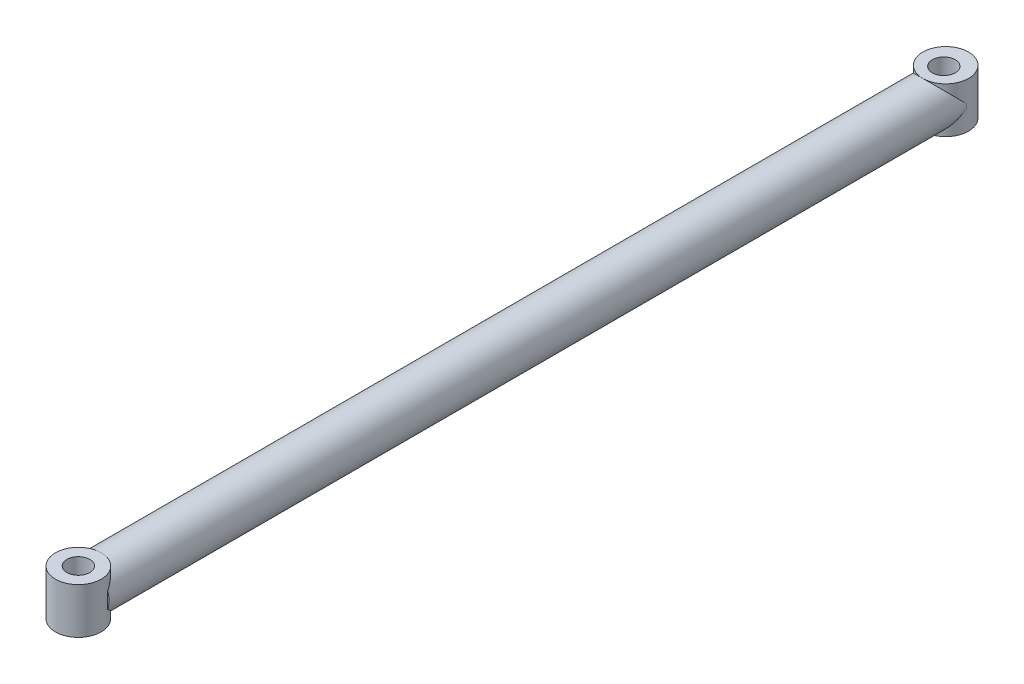
ISO-10303-21;
HEADER;
FILE_DESCRIPTION(('STEP AP214'),'2;1');
FILE_NAME('part.step','',(''),(''),'','','');
FILE_SCHEMA(('AUTOMOTIVE_DESIGN { 1 0 10303 214 1 1 1 1 }'));
ENDSEC;
DATA;
#1=APPLICATION_CONTEXT('core data for automotive mechanical design processes');
#2=APPLICATION_PROTOCOL_DEFINITION('international standard','automotive_design',2000,#1);
#3=PRODUCT_CONTEXT('',#1,'mechanical');
#4=PRODUCT('Part','Part','',(#3));
#5=PRODUCT_RELATED_PRODUCT_CATEGORY('part','',(#4));
#6=PRODUCT_DEFINITION_FORMATION('','',#4);
#7=PRODUCT_DEFINITION_CONTEXT('part definition',#1,'design');
#8=PRODUCT_DEFINITION('design','',#6,#7);
#9=PRODUCT_DEFINITION_SHAPE('','',#8);
#10=(LENGTH_UNIT() NAMED_UNIT(*) SI_UNIT(.MILLI.,.METRE.));
#11=(NAMED_UNIT(*) PLANE_ANGLE_UNIT() SI_UNIT($,.RADIAN.));
#12=(NAMED_UNIT(*) SI_UNIT($,.STERADIAN.) SOLID_ANGLE_UNIT());
#13=UNCERTAINTY_MEASURE_WITH_UNIT(LENGTH_MEASURE(1.E-05),#10,'distance_accuracy_value','');
#14=(GEOMETRIC_REPRESENTATION_CONTEXT(3) GLOBAL_UNCERTAINTY_ASSIGNED_CONTEXT((#13)) GLOBAL_UNIT_ASSIGNED_CONTEXT((#10,
#11,#12)) REPRESENTATION_CONTEXT('',''));
#15=CARTESIAN_POINT('',(0.,0.,0.));
#16=DIRECTION('',(0.,0.,1.));
#17=DIRECTION('',(1.,0.,0.));
#18=AXIS2_PLACEMENT_3D('',#15,#16,#17);
#19=CARTESIAN_POINT('',(0.,0.,0.));
#20=DIRECTION('',(0.,0.,1.));
#21=DIRECTION('',(1.,0.,0.));
#22=AXIS2_PLACEMENT_3D('',#19,#20,#21);
#23=PLANE('',#22);
#24=CARTESIAN_POINT('',(0.,0.,0.));
#25=DIRECTION('',(0.,0.,1.));
#26=DIRECTION('',(1.,0.,0.));
#27=AXIS2_PLACEMENT_3D('',#24,#25,#26);
#28=CIRCLE('',#27,2.);
#29=CARTESIAN_POINT('',(1.99350467347526,-0.161056253626736,0.));
#30=VERTEX_POINT('',#29);
#31=CARTESIAN_POINT('',(1.99350467347526,0.161056253626737,0.));
#32=VERTEX_POINT('',#31);
#33=EDGE_CURVE('E144',#30,#32,#28,.T.);
#34=ORIENTED_EDGE('',*,*,#33,.F.);
#35=DIRECTION('',(0.,1.,0.));
#36=VECTOR('',#35,1.);
#37=CARTESIAN_POINT('',(1.99350467347526,-2.,0.));
#38=LINE('',#37,#36);
#39=EDGE_CURVE('E11',#30,#32,#38,.T.);
#40=ORIENTED_EDGE('',*,*,#39,.T.);
#41=EDGE_LOOP('',(#34,#40));
#42=FACE_BOUND('',#41,.T.);
#43=ADVANCED_FACE('F39',(#42),#23,.F.);
#44=CARTESIAN_POINT('',(0.,0.,75.));
#45=DIRECTION('',(0.,0.,1.));
#46=DIRECTION('',(1.,0.,0.));
#47=AXIS2_PLACEMENT_3D('',#44,#45,#46);
#48=PLANE('',#47);
#49=DIRECTION('',(0.,1.,0.));
#50=VECTOR('',#49,1.);
#51=CARTESIAN_POINT('',(1.87763174463558,-2.,75.));
#52=LINE('',#51,#50);
#53=CARTESIAN_POINT('',(1.87763174463558,-0.688838901004249,75.));
#54=VERTEX_POINT('',#53);
#55=CARTESIAN_POINT('',(1.87763174463558,0.688838901004249,75.));
#56=VERTEX_POINT('',#55);
#57=EDGE_CURVE('E152',#54,#56,#52,.T.);
#58=ORIENTED_EDGE('',*,*,#57,.F.);
#59=CARTESIAN_POINT('',(0.,0.,75.));
#60=DIRECTION('',(0.,0.,1.));
#61=DIRECTION('',(1.,0.,0.));
#62=AXIS2_PLACEMENT_3D('',#59,#60,#61);
#63=CIRCLE('',#62,2.);
#64=EDGE_CURVE('E138',#54,#56,#63,.T.);
#65=ORIENTED_EDGE('',*,*,#64,.T.);
#66=EDGE_LOOP('',(#58,#65));
#67=FACE_BOUND('',#66,.T.);
#68=ADVANCED_FACE('F168',(#67),#48,.T.);
#69=CARTESIAN_POINT('',(0.,0.,75.));
#70=DIRECTION('',(0.,0.,-1.));
#71=DIRECTION('',(-1.,0.,0.));
#72=AXIS2_PLACEMENT_3D('',#69,#70,#71);
#73=CYLINDRICAL_SURFACE('',#72,2.);
#74=ORIENTED_EDGE('',*,*,#64,.F.);
#75=CARTESIAN_POINT('',(0.,0.,75.6888389010042));
#76=DIRECTION('',(0.,0.707106781186547,-0.707106781186547));
#77=DIRECTION('',(0.,-0.707106781186547,-0.707106781186547));
#78=AXIS2_PLACEMENT_3D('',#75,#76,#77);
#79=ELLIPSE('',#78,2.82842712474619,2.);
#80=CARTESIAN_POINT('',(0.,-2.,73.6888389010042));
#81=VERTEX_POINT('',#80);
#82=EDGE_CURVE('E63',#54,#81,#79,.T.);
#83=ORIENTED_EDGE('',*,*,#82,.T.);
#84=CARTESIAN_POINT('',(-1.87763174463558,-0.688838901004249,75.));
#85=VERTEX_POINT('',#84);
#86=EDGE_CURVE('E134',#81,#85,#79,.T.);
#87=ORIENTED_EDGE('',*,*,#86,.T.);
#88=CARTESIAN_POINT('',(-1.87763174463558,0.688838901004249,75.));
#89=VERTEX_POINT('',#88);
#90=EDGE_CURVE('E142',#89,#85,#63,.T.);
#91=ORIENTED_EDGE('',*,*,#90,.F.);
#92=CARTESIAN_POINT('',(0.,0.,75.6888389010042));
#93=DIRECTION('',(0.,-0.707106781186547,-0.707106781186547));
#94=DIRECTION('',(0.,0.707106781186547,-0.707106781186547));
#95=AXIS2_PLACEMENT_3D('',#92,#93,#94);
#96=ELLIPSE('',#95,2.82842712474619,2.);
#97=CARTESIAN_POINT('',(0.,2.,73.6888389010042));
#98=VERTEX_POINT('',#97);
#99=EDGE_CURVE('E127',#89,#98,#96,.T.);
#100=ORIENTED_EDGE('',*,*,#99,.T.);
#101=EDGE_CURVE('E135',#98,#56,#96,.T.);
#102=ORIENTED_EDGE('',*,*,#101,.T.);
#103=EDGE_LOOP('',(#74,#83,#87,#91,#100,#102));
#104=FACE_BOUND('',#103,.T.);
#105=ORIENTED_EDGE('',*,*,#33,.T.);
#106=CARTESIAN_POINT('',(0.,0.,-0.161056253626737));
#107=DIRECTION('',(0.,0.707106781186547,-0.707106781186547));
#108=DIRECTION('',(0.,-0.707106781186547,-0.707106781186547));
#109=AXIS2_PLACEMENT_3D('',#106,#107,#108);
#110=ELLIPSE('',#109,2.82842712474619,2.);
#111=CARTESIAN_POINT('',(0.,2.,1.83894374637326));
#112=VERTEX_POINT('',#111);
#113=EDGE_CURVE('E104',#32,#112,#110,.F.);
#114=ORIENTED_EDGE('',*,*,#113,.T.);
#115=CARTESIAN_POINT('',(-1.99350467347526,0.161056253626736,0.));
#116=VERTEX_POINT('',#115);
#117=EDGE_CURVE('E95',#112,#116,#110,.F.);
#118=ORIENTED_EDGE('',*,*,#117,.T.);
#119=CARTESIAN_POINT('',(-1.99350467347526,-0.161056253626736,0.));
#120=VERTEX_POINT('',#119);
#121=EDGE_CURVE('E143',#116,#120,#28,.T.);
#122=ORIENTED_EDGE('',*,*,#121,.T.);
#123=CARTESIAN_POINT('',(0.,0.,-0.161056253626737));
#124=DIRECTION('',(0.,-0.707106781186547,-0.707106781186547));
#125=DIRECTION('',(0.,0.707106781186547,-0.707106781186547));
#126=AXIS2_PLACEMENT_3D('',#123,#124,#125);
#127=ELLIPSE('',#126,2.82842712474619,2.);
#128=CARTESIAN_POINT('',(0.,-2.,1.83894374637326));
#129=VERTEX_POINT('',#128);
#130=EDGE_CURVE('E55',#120,#129,#127,.F.);
#131=ORIENTED_EDGE('',*,*,#130,.T.);
#132=EDGE_CURVE('E121',#129,#30,#127,.F.);
#133=ORIENTED_EDGE('',*,*,#132,.T.);
#134=EDGE_LOOP('',(#105,#114,#118,#122,#131,#133));
#135=FACE_BOUND('',#134,.T.);
#136=ADVANCED_FACE('F41',(#104,#135),#73,.T.);
#137=DIRECTION('',(0.,1.,0.));
#138=VECTOR('',#137,1.);
#139=CARTESIAN_POINT('',(-1.87763174463558,-2.,75.));
#140=LINE('',#139,#138);
#141=EDGE_CURVE('E148',#89,#85,#140,.F.);
#142=ORIENTED_EDGE('',*,*,#141,.F.);
#143=ORIENTED_EDGE('',*,*,#90,.T.);
#144=EDGE_LOOP('',(#142,#143));
#145=FACE_BOUND('',#144,.T.);
#146=ADVANCED_FACE('F174',(#145),#48,.T.);
#147=ORIENTED_EDGE('',*,*,#121,.F.);
#148=DIRECTION('',(0.,1.,0.));
#149=VECTOR('',#148,1.);
#150=CARTESIAN_POINT('',(-1.99350467347526,-2.,0.));
#151=LINE('',#150,#149);
#152=EDGE_CURVE('E48',#116,#120,#151,.F.);
#153=ORIENTED_EDGE('',*,*,#152,.T.);
#154=EDGE_LOOP('',(#147,#153));
#155=FACE_BOUND('',#154,.T.);
#156=ADVANCED_FACE('F157',(#155),#23,.F.);
#157=CARTESIAN_POINT('',(0.,-2.,75.6888389010042));
#158=DIRECTION('',(0.,1.,0.));
#159=DIRECTION('',(0.,0.,1.));
#160=AXIS2_PLACEMENT_3D('',#157,#158,#159);
#161=CYLINDRICAL_SURFACE('',#160,2.);
#162=ORIENTED_EDGE('',*,*,#101,.F.);
#163=CARTESIAN_POINT('',(0.,2.,75.6888389010042));
#164=DIRECTION('',(0.,1.,0.));
#165=DIRECTION('',(0.,0.,1.));
#166=AXIS2_PLACEMENT_3D('',#163,#164,#165);
#167=CIRCLE('',#166,2.);
#168=EDGE_CURVE('E128',#98,#98,#167,.T.);
#169=ORIENTED_EDGE('',*,*,#168,.F.);
#170=ORIENTED_EDGE('',*,*,#99,.F.);
#171=ORIENTED_EDGE('',*,*,#141,.T.);
#172=ORIENTED_EDGE('',*,*,#86,.F.);
#173=CARTESIAN_POINT('',(0.,-2.,75.6888389010042));
#174=DIRECTION('',(0.,1.,0.));
#175=DIRECTION('',(0.,0.,1.));
#176=AXIS2_PLACEMENT_3D('',#173,#174,#175);
#177=CIRCLE('',#176,2.);
#178=EDGE_CURVE('E123',#81,#81,#177,.T.);
#179=ORIENTED_EDGE('',*,*,#178,.T.);
#180=ORIENTED_EDGE('',*,*,#82,.F.);
#181=ORIENTED_EDGE('',*,*,#57,.T.);
#182=EDGE_LOOP('',(#162,#169,#170,#171,#172,#179,#180,#181));
#183=FACE_BOUND('',#182,.T.);
#184=ADVANCED_FACE('F176',(#183),#161,.T.);
#185=CARTESIAN_POINT('',(0.,-2.,75.6888389010042));
#186=DIRECTION('',(0.,1.,0.));
#187=DIRECTION('',(0.,0.,1.));
#188=AXIS2_PLACEMENT_3D('',#185,#186,#187);
#189=PLANE('',#188);
#190=CARTESIAN_POINT('',(0.,-2.,75.6888389010042));
#191=DIRECTION('',(0.,1.,0.));
#192=DIRECTION('',(0.,0.,1.));
#193=AXIS2_PLACEMENT_3D('',#190,#191,#192);
#194=CIRCLE('',#193,1.);
#195=CARTESIAN_POINT('',(0.,-2.,76.6888389010042));
#196=VERTEX_POINT('',#195);
#197=EDGE_CURVE('E110',#196,#196,#194,.T.);
#198=ORIENTED_EDGE('',*,*,#197,.T.);
#199=EDGE_LOOP('',(#198));
#200=FACE_BOUND('',#199,.T.);
#201=ORIENTED_EDGE('',*,*,#178,.F.);
#202=EDGE_LOOP('',(#201));
#203=FACE_BOUND('',#202,.T.);
#204=ADVANCED_FACE('F181',(#200,#203),#189,.F.);
#205=CARTESIAN_POINT('',(0.,2.,75.6888389010042));
#206=DIRECTION('',(0.,1.,0.));
#207=DIRECTION('',(0.,0.,1.));
#208=AXIS2_PLACEMENT_3D('',#205,#206,#207);
#209=PLANE('',#208);
#210=CARTESIAN_POINT('',(0.,2.,75.6888389010042));
#211=DIRECTION('',(0.,1.,0.));
#212=DIRECTION('',(0.,0.,1.));
#213=AXIS2_PLACEMENT_3D('',#210,#211,#212);
#214=CIRCLE('',#213,1.);
#215=CARTESIAN_POINT('',(0.,2.,76.6888389010042));
#216=VERTEX_POINT('',#215);
#217=EDGE_CURVE('E116',#216,#216,#214,.T.);
#218=ORIENTED_EDGE('',*,*,#217,.F.);
#219=EDGE_LOOP('',(#218));
#220=FACE_BOUND('',#219,.T.);
#221=ORIENTED_EDGE('',*,*,#168,.T.);
#222=EDGE_LOOP('',(#221));
#223=FACE_BOUND('',#222,.T.);
#224=ADVANCED_FACE('F189',(#220,#223),#209,.T.);
#225=CARTESIAN_POINT('',(0.,-2.,-0.161056253626737));
#226=DIRECTION('',(0.,1.,0.));
#227=DIRECTION('',(0.,0.,1.));
#228=AXIS2_PLACEMENT_3D('',#225,#226,#227);
#229=CYLINDRICAL_SURFACE('',#228,2.);
#230=ORIENTED_EDGE('',*,*,#132,.F.);
#231=CARTESIAN_POINT('',(0.,-2.,-0.161056253626737));
#232=DIRECTION('',(0.,1.,0.));
#233=DIRECTION('',(0.,0.,1.));
#234=AXIS2_PLACEMENT_3D('',#231,#232,#233);
#235=CIRCLE('',#234,2.);
#236=EDGE_CURVE('E109',#129,#129,#235,.T.);
#237=ORIENTED_EDGE('',*,*,#236,.T.);
#238=ORIENTED_EDGE('',*,*,#130,.F.);
#239=ORIENTED_EDGE('',*,*,#152,.F.);
#240=ORIENTED_EDGE('',*,*,#117,.F.);
#241=CARTESIAN_POINT('',(0.,2.,-0.161056253626737));
#242=DIRECTION('',(0.,1.,0.));
#243=DIRECTION('',(0.,0.,1.));
#244=AXIS2_PLACEMENT_3D('',#241,#242,#243);
#245=CIRCLE('',#244,2.);
#246=EDGE_CURVE('E98',#112,#112,#245,.T.);
#247=ORIENTED_EDGE('',*,*,#246,.F.);
#248=ORIENTED_EDGE('',*,*,#113,.F.);
#249=ORIENTED_EDGE('',*,*,#39,.F.);
#250=EDGE_LOOP('',(#230,#237,#238,#239,#240,#247,#248,#249));
#251=FACE_BOUND('',#250,.T.);
#252=ADVANCED_FACE('F97',(#251),#229,.T.);
#253=CARTESIAN_POINT('',(0.,-2.,-0.161056253626737));
#254=DIRECTION('',(0.,1.,0.));
#255=DIRECTION('',(0.,0.,1.));
#256=AXIS2_PLACEMENT_3D('',#253,#254,#255);
#257=PLANE('',#256);
#258=CARTESIAN_POINT('',(0.,-2.,0.));
#259=DIRECTION('',(0.,1.,0.));
#260=DIRECTION('',(0.,0.,1.));
#261=AXIS2_PLACEMENT_3D('',#258,#259,#260);
#262=CIRCLE('',#261,1.);
#263=CARTESIAN_POINT('',(0.,-2.,1.));
#264=VERTEX_POINT('',#263);
#265=EDGE_CURVE('E219',#264,#264,#262,.T.);
#266=ORIENTED_EDGE('',*,*,#265,.T.);
#267=EDGE_LOOP('',(#266));
#268=FACE_BOUND('',#267,.T.);
#269=ORIENTED_EDGE('',*,*,#236,.F.);
#270=EDGE_LOOP('',(#269));
#271=FACE_BOUND('',#270,.T.);
#272=ADVANCED_FACE('F198',(#268,#271),#257,.F.);
#273=CARTESIAN_POINT('',(0.,2.,-0.161056253626737));
#274=DIRECTION('',(0.,1.,0.));
#275=DIRECTION('',(0.,0.,1.));
#276=AXIS2_PLACEMENT_3D('',#273,#274,#275);
#277=PLANE('',#276);
#278=CARTESIAN_POINT('',(0.,2.,0.));
#279=DIRECTION('',(0.,1.,0.));
#280=DIRECTION('',(0.,0.,1.));
#281=AXIS2_PLACEMENT_3D('',#278,#279,#280);
#282=CIRCLE('',#281,1.);
#283=CARTESIAN_POINT('',(0.,2.,1.));
#284=VERTEX_POINT('',#283);
#285=EDGE_CURVE('E223',#284,#284,#282,.T.);
#286=ORIENTED_EDGE('',*,*,#285,.F.);
#287=EDGE_LOOP('',(#286));
#288=FACE_BOUND('',#287,.T.);
#289=ORIENTED_EDGE('',*,*,#246,.T.);
#290=EDGE_LOOP('',(#289));
#291=FACE_BOUND('',#290,.T.);
#292=ADVANCED_FACE('F107',(#288,#291),#277,.T.);
#293=CARTESIAN_POINT('',(0.,-2.,0.));
#294=DIRECTION('',(0.,1.,0.));
#295=DIRECTION('',(0.,0.,1.));
#296=AXIS2_PLACEMENT_3D('',#293,#294,#295);
#297=CYLINDRICAL_SURFACE('',#296,1.);
#298=ORIENTED_EDGE('',*,*,#265,.F.);
#299=EDGE_LOOP('',(#298));
#300=FACE_BOUND('',#299,.T.);
#301=ORIENTED_EDGE('',*,*,#285,.T.);
#302=EDGE_LOOP('',(#301));
#303=FACE_BOUND('',#302,.T.);
#304=ADVANCED_FACE('F201',(#300,#303),#297,.F.);
#305=CARTESIAN_POINT('',(0.,-2.,75.6888389010042));
#306=DIRECTION('',(0.,1.,0.));
#307=DIRECTION('',(0.,0.,1.));
#308=AXIS2_PLACEMENT_3D('',#305,#306,#307);
#309=CYLINDRICAL_SURFACE('',#308,1.);
#310=ORIENTED_EDGE('',*,*,#197,.F.);
#311=EDGE_LOOP('',(#310));
#312=FACE_BOUND('',#311,.T.);
#313=ORIENTED_EDGE('',*,*,#217,.T.);
#314=EDGE_LOOP('',(#313));
#315=FACE_BOUND('',#314,.T.);
#316=ADVANCED_FACE('F208',(#312,#315),#309,.F.);
#317=CLOSED_SHELL('',(#43,#68,#136,#146,#156,#184,#204,#224,#252,#272,#292,#304,#316));
#318=MANIFOLD_SOLID_BREP('B2',#317);
#319=ADVANCED_BREP_SHAPE_REPRESENTATION('',(#18,#318),#14);
#320=SHAPE_DEFINITION_REPRESENTATION(#9,#319);
ENDSEC;
END-ISO-10303-21;
